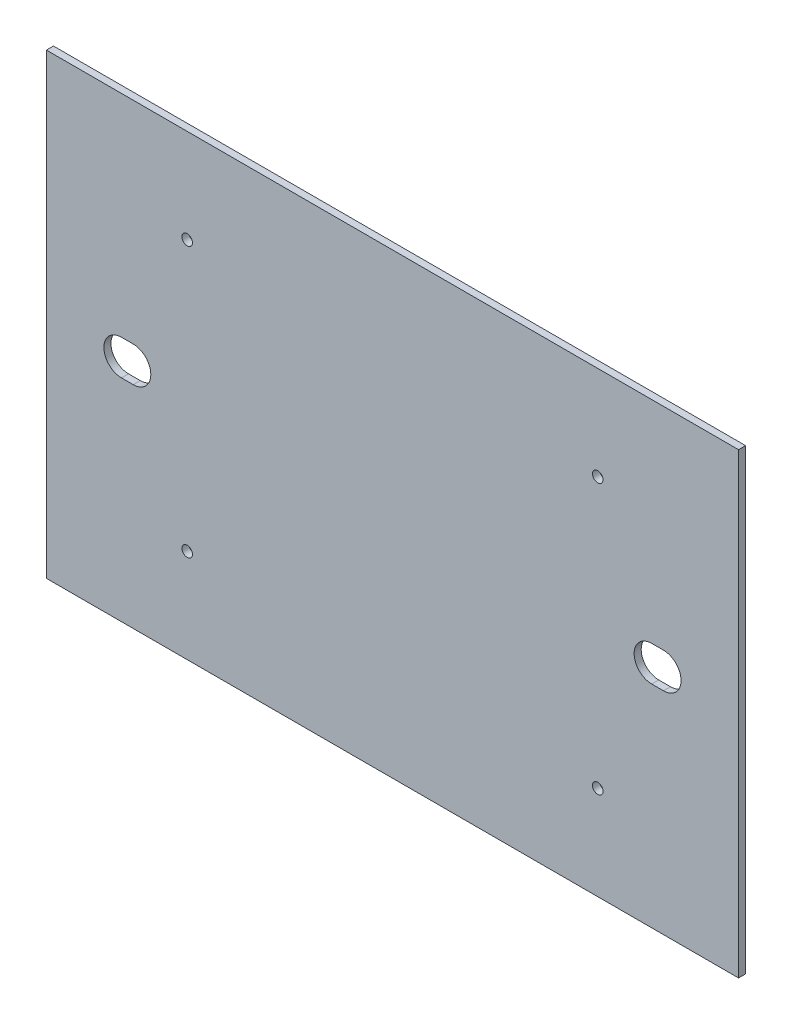
ISO-10303-21;
HEADER;
FILE_DESCRIPTION(('STEP AP214'),'2;1');
FILE_NAME('part.step','',(''),(''),'','','');
FILE_SCHEMA(('AUTOMOTIVE_DESIGN { 1 0 10303 214 1 1 1 1 }'));
ENDSEC;
DATA;
#1=APPLICATION_CONTEXT('core data for automotive mechanical design processes');
#2=APPLICATION_PROTOCOL_DEFINITION('international standard','automotive_design',2000,#1);
#3=PRODUCT_CONTEXT('',#1,'mechanical');
#4=PRODUCT('Part','Part','',(#3));
#5=PRODUCT_RELATED_PRODUCT_CATEGORY('part','',(#4));
#6=PRODUCT_DEFINITION_FORMATION('','',#4);
#7=PRODUCT_DEFINITION_CONTEXT('part definition',#1,'design');
#8=PRODUCT_DEFINITION('design','',#6,#7);
#9=PRODUCT_DEFINITION_SHAPE('','',#8);
#10=(LENGTH_UNIT() NAMED_UNIT(*) SI_UNIT(.MILLI.,.METRE.));
#11=(NAMED_UNIT(*) PLANE_ANGLE_UNIT() SI_UNIT($,.RADIAN.));
#12=(NAMED_UNIT(*) SI_UNIT($,.STERADIAN.) SOLID_ANGLE_UNIT());
#13=UNCERTAINTY_MEASURE_WITH_UNIT(LENGTH_MEASURE(1.E-05),#10,'distance_accuracy_value','');
#14=(GEOMETRIC_REPRESENTATION_CONTEXT(3) GLOBAL_UNCERTAINTY_ASSIGNED_CONTEXT((#13)) GLOBAL_UNIT_ASSIGNED_CONTEXT((#10,
#11,#12)) REPRESENTATION_CONTEXT('',''));
#15=CARTESIAN_POINT('',(0.,0.,0.));
#16=DIRECTION('',(0.,0.,1.));
#17=DIRECTION('',(1.,0.,0.));
#18=AXIS2_PLACEMENT_3D('',#15,#16,#17);
#19=CARTESIAN_POINT('',(0.,-195.,3.));
#20=DIRECTION('',(0.,0.,1.));
#21=DIRECTION('',(1.,0.,0.));
#22=AXIS2_PLACEMENT_3D('',#19,#20,#21);
#23=PLANE('',#22);
#24=DIRECTION('',(1.,0.,0.));
#25=VECTOR('',#24,1.);
#26=CARTESIAN_POINT('',(263.,-105.,3.));
#27=LINE('',#26,#25);
#28=CARTESIAN_POINT('',(258.,-105.,3.));
#29=VERTEX_POINT('',#28);
#30=CARTESIAN_POINT('',(263.,-105.,3.));
#31=VERTEX_POINT('',#30);
#32=EDGE_CURVE('E158',#29,#31,#27,.T.);
#33=ORIENTED_EDGE('',*,*,#32,.F.);
#34=CARTESIAN_POINT('',(258.,-97.5,3.));
#35=DIRECTION('',(0.,0.,1.));
#36=DIRECTION('',(-1.,0.,0.));
#37=AXIS2_PLACEMENT_3D('',#34,#35,#36);
#38=CIRCLE('',#37,7.50000000000001);
#39=CARTESIAN_POINT('',(258.,-90.,3.));
#40=VERTEX_POINT('',#39);
#41=EDGE_CURVE('E156',#40,#29,#38,.T.);
#42=ORIENTED_EDGE('',*,*,#41,.F.);
#43=DIRECTION('',(-1.,0.,0.));
#44=VECTOR('',#43,1.);
#45=CARTESIAN_POINT('',(263.,-90.,3.));
#46=LINE('',#45,#44);
#47=CARTESIAN_POINT('',(263.,-90.,3.));
#48=VERTEX_POINT('',#47);
#49=EDGE_CURVE('E164',#48,#40,#46,.T.);
#50=ORIENTED_EDGE('',*,*,#49,.F.);
#51=CARTESIAN_POINT('',(263.,-97.5,3.));
#52=DIRECTION('',(0.,0.,1.));
#53=DIRECTION('',(-1.,0.,0.));
#54=AXIS2_PLACEMENT_3D('',#51,#52,#53);
#55=CIRCLE('',#54,7.50000000000001);
#56=EDGE_CURVE('E161',#31,#48,#55,.T.);
#57=ORIENTED_EDGE('',*,*,#56,.F.);
#58=EDGE_LOOP('',(#33,#42,#50,#57));
#59=FACE_BOUND('',#58,.T.);
#60=CARTESIAN_POINT('',(235.,-155.,3.));
#61=DIRECTION('',(0.,0.,1.));
#62=DIRECTION('',(1.,0.,0.));
#63=AXIS2_PLACEMENT_3D('',#60,#61,#62);
#64=CIRCLE('',#63,2.25000000000001);
#65=CARTESIAN_POINT('',(237.25,-155.,3.));
#66=VERTEX_POINT('',#65);
#67=EDGE_CURVE('E193',#66,#66,#64,.T.);
#68=ORIENTED_EDGE('',*,*,#67,.F.);
#69=EDGE_LOOP('',(#68));
#70=FACE_BOUND('',#69,.T.);
#71=CARTESIAN_POINT('',(60.,-40.,3.));
#72=DIRECTION('',(0.,0.,1.));
#73=DIRECTION('',(1.,0.,0.));
#74=AXIS2_PLACEMENT_3D('',#71,#72,#73);
#75=CIRCLE('',#74,2.25);
#76=CARTESIAN_POINT('',(62.25,-40.,3.));
#77=VERTEX_POINT('',#76);
#78=EDGE_CURVE('E205',#77,#77,#75,.T.);
#79=ORIENTED_EDGE('',*,*,#78,.F.);
#80=EDGE_LOOP('',(#79));
#81=FACE_BOUND('',#80,.T.);
#82=DIRECTION('',(0.,-1.,0.));
#83=VECTOR('',#82,1.);
#84=CARTESIAN_POINT('',(0.,0.,3.));
#85=LINE('',#84,#83);
#86=CARTESIAN_POINT('',(0.,0.,3.));
#87=VERTEX_POINT('',#86);
#88=CARTESIAN_POINT('',(0.,-195.,3.));
#89=VERTEX_POINT('',#88);
#90=EDGE_CURVE('E211',#87,#89,#85,.T.);
#91=ORIENTED_EDGE('',*,*,#90,.T.);
#92=DIRECTION('',(1.,0.,0.));
#93=VECTOR('',#92,1.);
#94=CARTESIAN_POINT('',(0.,-195.,3.));
#95=LINE('',#94,#93);
#96=CARTESIAN_POINT('',(295.,-195.,3.));
#97=VERTEX_POINT('',#96);
#98=EDGE_CURVE('E214',#89,#97,#95,.T.);
#99=ORIENTED_EDGE('',*,*,#98,.T.);
#100=DIRECTION('',(0.,1.,0.));
#101=VECTOR('',#100,1.);
#102=CARTESIAN_POINT('',(295.,0.,3.));
#103=LINE('',#102,#101);
#104=CARTESIAN_POINT('',(295.,0.,3.));
#105=VERTEX_POINT('',#104);
#106=EDGE_CURVE('E217',#97,#105,#103,.T.);
#107=ORIENTED_EDGE('',*,*,#106,.T.);
#108=DIRECTION('',(-1.,0.,0.));
#109=VECTOR('',#108,1.);
#110=CARTESIAN_POINT('',(0.,0.,3.));
#111=LINE('',#110,#109);
#112=EDGE_CURVE('E219',#105,#87,#111,.T.);
#113=ORIENTED_EDGE('',*,*,#112,.T.);
#114=EDGE_LOOP('',(#91,#99,#107,#113));
#115=FACE_BOUND('',#114,.T.);
#116=CARTESIAN_POINT('',(235.,-40.,3.));
#117=DIRECTION('',(0.,0.,1.));
#118=DIRECTION('',(-1.,0.,0.));
#119=AXIS2_PLACEMENT_3D('',#116,#117,#118);
#120=CIRCLE('',#119,2.25000000000001);
#121=CARTESIAN_POINT('',(232.75,-40.,3.));
#122=VERTEX_POINT('',#121);
#123=EDGE_CURVE('E199',#122,#122,#120,.T.);
#124=ORIENTED_EDGE('',*,*,#123,.F.);
#125=EDGE_LOOP('',(#124));
#126=FACE_BOUND('',#125,.T.);
#127=CARTESIAN_POINT('',(60.,-155.,3.));
#128=DIRECTION('',(0.,0.,1.));
#129=DIRECTION('',(-1.,0.,0.));
#130=AXIS2_PLACEMENT_3D('',#127,#128,#129);
#131=CIRCLE('',#130,2.25);
#132=CARTESIAN_POINT('',(57.75,-155.,3.));
#133=VERTEX_POINT('',#132);
#134=EDGE_CURVE('E187',#133,#133,#131,.T.);
#135=ORIENTED_EDGE('',*,*,#134,.F.);
#136=EDGE_LOOP('',(#135));
#137=FACE_BOUND('',#136,.T.);
#138=DIRECTION('',(1.,0.,0.));
#139=VECTOR('',#138,1.);
#140=CARTESIAN_POINT('',(32.,-105.,3.));
#141=LINE('',#140,#139);
#142=CARTESIAN_POINT('',(32.,-105.,3.));
#143=VERTEX_POINT('',#142);
#144=CARTESIAN_POINT('',(37.,-105.,3.));
#145=VERTEX_POINT('',#144);
#146=EDGE_CURVE('E128',#143,#145,#141,.T.);
#147=ORIENTED_EDGE('',*,*,#146,.F.);
#148=CARTESIAN_POINT('',(32.,-97.5,3.));
#149=DIRECTION('',(0.,0.,1.));
#150=DIRECTION('',(1.,0.,0.));
#151=AXIS2_PLACEMENT_3D('',#148,#149,#150);
#152=CIRCLE('',#151,7.50000000000001);
#153=CARTESIAN_POINT('',(32.,-90.,3.));
#154=VERTEX_POINT('',#153);
#155=EDGE_CURVE('E120',#154,#143,#152,.T.);
#156=ORIENTED_EDGE('',*,*,#155,.F.);
#157=DIRECTION('',(-1.,0.,0.));
#158=VECTOR('',#157,1.);
#159=CARTESIAN_POINT('',(32.,-90.,3.));
#160=LINE('',#159,#158);
#161=CARTESIAN_POINT('',(37.,-90.,3.));
#162=VERTEX_POINT('',#161);
#163=EDGE_CURVE('E142',#162,#154,#160,.T.);
#164=ORIENTED_EDGE('',*,*,#163,.F.);
#165=CARTESIAN_POINT('',(37.,-97.5,3.));
#166=DIRECTION('',(0.,0.,1.));
#167=DIRECTION('',(1.,0.,0.));
#168=AXIS2_PLACEMENT_3D('',#165,#166,#167);
#169=CIRCLE('',#168,7.50000000000001);
#170=EDGE_CURVE('E140',#145,#162,#169,.T.);
#171=ORIENTED_EDGE('',*,*,#170,.F.);
#172=EDGE_LOOP('',(#147,#156,#164,#171));
#173=FACE_BOUND('',#172,.T.);
#174=ADVANCED_FACE('F31',(#59,#70,#81,#115,#126,#137,#173),#23,.T.);
#175=CARTESIAN_POINT('',(0.,-195.,0.));
#176=DIRECTION('',(0.,0.,1.));
#177=DIRECTION('',(1.,0.,0.));
#178=AXIS2_PLACEMENT_3D('',#175,#176,#177);
#179=PLANE('',#178);
#180=CARTESIAN_POINT('',(258.,-97.5,0.));
#181=DIRECTION('',(0.,0.,1.));
#182=DIRECTION('',(-1.,0.,0.));
#183=AXIS2_PLACEMENT_3D('',#180,#181,#182);
#184=CIRCLE('',#183,7.50000000000001);
#185=CARTESIAN_POINT('',(258.,-90.,0.));
#186=VERTEX_POINT('',#185);
#187=CARTESIAN_POINT('',(258.,-105.,0.));
#188=VERTEX_POINT('',#187);
#189=EDGE_CURVE('E136',#186,#188,#184,.T.);
#190=ORIENTED_EDGE('',*,*,#189,.T.);
#191=DIRECTION('',(1.,0.,0.));
#192=VECTOR('',#191,1.);
#193=CARTESIAN_POINT('',(263.,-105.,0.));
#194=LINE('',#193,#192);
#195=CARTESIAN_POINT('',(263.,-105.,0.));
#196=VERTEX_POINT('',#195);
#197=EDGE_CURVE('E169',#188,#196,#194,.T.);
#198=ORIENTED_EDGE('',*,*,#197,.T.);
#199=CARTESIAN_POINT('',(263.,-97.5,0.));
#200=DIRECTION('',(0.,0.,1.));
#201=DIRECTION('',(-1.,0.,0.));
#202=AXIS2_PLACEMENT_3D('',#199,#200,#201);
#203=CIRCLE('',#202,7.50000000000001);
#204=CARTESIAN_POINT('',(263.,-90.,0.));
#205=VERTEX_POINT('',#204);
#206=EDGE_CURVE('E172',#196,#205,#203,.T.);
#207=ORIENTED_EDGE('',*,*,#206,.T.);
#208=DIRECTION('',(-1.,0.,0.));
#209=VECTOR('',#208,1.);
#210=CARTESIAN_POINT('',(263.,-90.,0.));
#211=LINE('',#210,#209);
#212=EDGE_CURVE('E159',#205,#186,#211,.T.);
#213=ORIENTED_EDGE('',*,*,#212,.T.);
#214=EDGE_LOOP('',(#190,#198,#207,#213));
#215=FACE_BOUND('',#214,.T.);
#216=CARTESIAN_POINT('',(235.,-155.,0.));
#217=DIRECTION('',(0.,0.,1.));
#218=DIRECTION('',(1.,0.,0.));
#219=AXIS2_PLACEMENT_3D('',#216,#217,#218);
#220=CIRCLE('',#219,2.25000000000001);
#221=CARTESIAN_POINT('',(237.25,-155.,0.));
#222=VERTEX_POINT('',#221);
#223=EDGE_CURVE('E190',#222,#222,#220,.T.);
#224=ORIENTED_EDGE('',*,*,#223,.T.);
#225=EDGE_LOOP('',(#224));
#226=FACE_BOUND('',#225,.T.);
#227=CARTESIAN_POINT('',(60.,-40.,0.));
#228=DIRECTION('',(0.,0.,1.));
#229=DIRECTION('',(1.,0.,0.));
#230=AXIS2_PLACEMENT_3D('',#227,#228,#229);
#231=CIRCLE('',#230,2.25);
#232=CARTESIAN_POINT('',(62.25,-40.,0.));
#233=VERTEX_POINT('',#232);
#234=EDGE_CURVE('E202',#233,#233,#231,.T.);
#235=ORIENTED_EDGE('',*,*,#234,.T.);
#236=EDGE_LOOP('',(#235));
#237=FACE_BOUND('',#236,.T.);
#238=DIRECTION('',(0.,-1.,0.));
#239=VECTOR('',#238,1.);
#240=CARTESIAN_POINT('',(0.,0.,0.));
#241=LINE('',#240,#239);
#242=CARTESIAN_POINT('',(0.,0.,0.));
#243=VERTEX_POINT('',#242);
#244=CARTESIAN_POINT('',(0.,-195.,0.));
#245=VERTEX_POINT('',#244);
#246=EDGE_CURVE('E208',#243,#245,#241,.T.);
#247=ORIENTED_EDGE('',*,*,#246,.F.);
#248=DIRECTION('',(-1.,0.,0.));
#249=VECTOR('',#248,1.);
#250=CARTESIAN_POINT('',(0.,0.,0.));
#251=LINE('',#250,#249);
#252=CARTESIAN_POINT('',(295.,0.,0.));
#253=VERTEX_POINT('',#252);
#254=EDGE_CURVE('E215',#253,#243,#251,.T.);
#255=ORIENTED_EDGE('',*,*,#254,.F.);
#256=DIRECTION('',(0.,1.,0.));
#257=VECTOR('',#256,1.);
#258=CARTESIAN_POINT('',(295.,0.,0.));
#259=LINE('',#258,#257);
#260=CARTESIAN_POINT('',(295.,-195.,0.));
#261=VERTEX_POINT('',#260);
#262=EDGE_CURVE('E226',#261,#253,#259,.T.);
#263=ORIENTED_EDGE('',*,*,#262,.F.);
#264=DIRECTION('',(1.,0.,0.));
#265=VECTOR('',#264,1.);
#266=CARTESIAN_POINT('',(0.,-195.,0.));
#267=LINE('',#266,#265);
#268=EDGE_CURVE('E224',#245,#261,#267,.T.);
#269=ORIENTED_EDGE('',*,*,#268,.F.);
#270=EDGE_LOOP('',(#247,#255,#263,#269));
#271=FACE_BOUND('',#270,.T.);
#272=CARTESIAN_POINT('',(235.,-40.,0.));
#273=DIRECTION('',(0.,0.,1.));
#274=DIRECTION('',(-1.,0.,0.));
#275=AXIS2_PLACEMENT_3D('',#272,#273,#274);
#276=CIRCLE('',#275,2.25000000000001);
#277=CARTESIAN_POINT('',(232.75,-40.,0.));
#278=VERTEX_POINT('',#277);
#279=EDGE_CURVE('E196',#278,#278,#276,.T.);
#280=ORIENTED_EDGE('',*,*,#279,.T.);
#281=EDGE_LOOP('',(#280));
#282=FACE_BOUND('',#281,.T.);
#283=CARTESIAN_POINT('',(60.,-155.,0.));
#284=DIRECTION('',(0.,0.,1.));
#285=DIRECTION('',(-1.,0.,0.));
#286=AXIS2_PLACEMENT_3D('',#283,#284,#285);
#287=CIRCLE('',#286,2.25);
#288=CARTESIAN_POINT('',(57.75,-155.,0.));
#289=VERTEX_POINT('',#288);
#290=EDGE_CURVE('E186',#289,#289,#287,.T.);
#291=ORIENTED_EDGE('',*,*,#290,.T.);
#292=EDGE_LOOP('',(#291));
#293=FACE_BOUND('',#292,.T.);
#294=CARTESIAN_POINT('',(32.,-97.5,0.));
#295=DIRECTION('',(0.,0.,1.));
#296=DIRECTION('',(1.,0.,0.));
#297=AXIS2_PLACEMENT_3D('',#294,#295,#296);
#298=CIRCLE('',#297,7.50000000000001);
#299=CARTESIAN_POINT('',(32.,-90.,0.));
#300=VERTEX_POINT('',#299);
#301=CARTESIAN_POINT('',(32.,-105.,0.));
#302=VERTEX_POINT('',#301);
#303=EDGE_CURVE('E54',#300,#302,#298,.T.);
#304=ORIENTED_EDGE('',*,*,#303,.T.);
#305=DIRECTION('',(1.,0.,0.));
#306=VECTOR('',#305,1.);
#307=CARTESIAN_POINT('',(32.,-105.,0.));
#308=LINE('',#307,#306);
#309=CARTESIAN_POINT('',(37.,-105.,0.));
#310=VERTEX_POINT('',#309);
#311=EDGE_CURVE('E135',#302,#310,#308,.T.);
#312=ORIENTED_EDGE('',*,*,#311,.T.);
#313=CARTESIAN_POINT('',(37.,-97.5,0.));
#314=DIRECTION('',(0.,0.,1.));
#315=DIRECTION('',(1.,0.,0.));
#316=AXIS2_PLACEMENT_3D('',#313,#314,#315);
#317=CIRCLE('',#316,7.50000000000001);
#318=CARTESIAN_POINT('',(37.,-90.,0.));
#319=VERTEX_POINT('',#318);
#320=EDGE_CURVE('E148',#310,#319,#317,.T.);
#321=ORIENTED_EDGE('',*,*,#320,.T.);
#322=DIRECTION('',(-1.,0.,0.));
#323=VECTOR('',#322,1.);
#324=CARTESIAN_POINT('',(32.,-90.,0.));
#325=LINE('',#324,#323);
#326=EDGE_CURVE('E129',#319,#300,#325,.T.);
#327=ORIENTED_EDGE('',*,*,#326,.T.);
#328=EDGE_LOOP('',(#304,#312,#321,#327));
#329=FACE_BOUND('',#328,.T.);
#330=ADVANCED_FACE('F244',(#215,#226,#237,#271,#282,#293,#329),#179,.F.);
#331=CARTESIAN_POINT('',(0.,0.,3.));
#332=DIRECTION('',(1.,0.,0.));
#333=DIRECTION('',(0.,1.,0.));
#334=AXIS2_PLACEMENT_3D('',#331,#332,#333);
#335=PLANE('',#334);
#336=ORIENTED_EDGE('',*,*,#246,.T.);
#337=DIRECTION('',(0.,0.,-1.));
#338=VECTOR('',#337,1.);
#339=CARTESIAN_POINT('',(0.,-195.,3.));
#340=LINE('',#339,#338);
#341=EDGE_CURVE('E11',#89,#245,#340,.T.);
#342=ORIENTED_EDGE('',*,*,#341,.F.);
#343=ORIENTED_EDGE('',*,*,#90,.F.);
#344=DIRECTION('',(0.,0.,-1.));
#345=VECTOR('',#344,1.);
#346=CARTESIAN_POINT('',(0.,0.,3.));
#347=LINE('',#346,#345);
#348=EDGE_CURVE('E221',#87,#243,#347,.T.);
#349=ORIENTED_EDGE('',*,*,#348,.T.);
#350=EDGE_LOOP('',(#336,#342,#343,#349));
#351=FACE_BOUND('',#350,.T.);
#352=ADVANCED_FACE('F33',(#351),#335,.F.);
#353=CARTESIAN_POINT('',(0.,-195.,3.));
#354=DIRECTION('',(0.,1.,0.));
#355=DIRECTION('',(0.,0.,1.));
#356=AXIS2_PLACEMENT_3D('',#353,#354,#355);
#357=PLANE('',#356);
#358=ORIENTED_EDGE('',*,*,#268,.T.);
#359=DIRECTION('',(0.,0.,-1.));
#360=VECTOR('',#359,1.);
#361=CARTESIAN_POINT('',(295.,-195.,3.));
#362=LINE('',#361,#360);
#363=EDGE_CURVE('E39',#97,#261,#362,.T.);
#364=ORIENTED_EDGE('',*,*,#363,.F.);
#365=ORIENTED_EDGE('',*,*,#98,.F.);
#366=ORIENTED_EDGE('',*,*,#341,.T.);
#367=EDGE_LOOP('',(#358,#364,#365,#366));
#368=FACE_BOUND('',#367,.T.);
#369=ADVANCED_FACE('F255',(#368),#357,.F.);
#370=CARTESIAN_POINT('',(295.,0.,3.));
#371=DIRECTION('',(-1.,0.,0.));
#372=DIRECTION('',(0.,0.,1.));
#373=AXIS2_PLACEMENT_3D('',#370,#371,#372);
#374=PLANE('',#373);
#375=ORIENTED_EDGE('',*,*,#262,.T.);
#376=DIRECTION('',(0.,0.,-1.));
#377=VECTOR('',#376,1.);
#378=CARTESIAN_POINT('',(295.,0.,3.));
#379=LINE('',#378,#377);
#380=EDGE_CURVE('E231',#105,#253,#379,.T.);
#381=ORIENTED_EDGE('',*,*,#380,.F.);
#382=ORIENTED_EDGE('',*,*,#106,.F.);
#383=ORIENTED_EDGE('',*,*,#363,.T.);
#384=EDGE_LOOP('',(#375,#381,#382,#383));
#385=FACE_BOUND('',#384,.T.);
#386=ADVANCED_FACE('F238',(#385),#374,.F.);
#387=CARTESIAN_POINT('',(0.,0.,3.));
#388=DIRECTION('',(0.,-1.,0.));
#389=DIRECTION('',(0.,0.,-1.));
#390=AXIS2_PLACEMENT_3D('',#387,#388,#389);
#391=PLANE('',#390);
#392=ORIENTED_EDGE('',*,*,#254,.T.);
#393=ORIENTED_EDGE('',*,*,#348,.F.);
#394=ORIENTED_EDGE('',*,*,#112,.F.);
#395=ORIENTED_EDGE('',*,*,#380,.T.);
#396=EDGE_LOOP('',(#392,#393,#394,#395));
#397=FACE_BOUND('',#396,.T.);
#398=ADVANCED_FACE('F248',(#397),#391,.F.);
#399=CARTESIAN_POINT('',(60.,-40.,3.));
#400=DIRECTION('',(0.,0.,-1.));
#401=DIRECTION('',(-1.,0.,0.));
#402=AXIS2_PLACEMENT_3D('',#399,#400,#401);
#403=CYLINDRICAL_SURFACE('',#402,2.25);
#404=ORIENTED_EDGE('',*,*,#78,.T.);
#405=EDGE_LOOP('',(#404));
#406=FACE_BOUND('',#405,.T.);
#407=ORIENTED_EDGE('',*,*,#234,.F.);
#408=EDGE_LOOP('',(#407));
#409=FACE_BOUND('',#408,.T.);
#410=ADVANCED_FACE('F273',(#406,#409),#403,.F.);
#411=CARTESIAN_POINT('',(235.,-40.,3.));
#412=DIRECTION('',(0.,0.,-1.));
#413=DIRECTION('',(-1.,0.,0.));
#414=AXIS2_PLACEMENT_3D('',#411,#412,#413);
#415=CYLINDRICAL_SURFACE('',#414,2.25000000000001);
#416=ORIENTED_EDGE('',*,*,#123,.T.);
#417=EDGE_LOOP('',(#416));
#418=FACE_BOUND('',#417,.T.);
#419=ORIENTED_EDGE('',*,*,#279,.F.);
#420=EDGE_LOOP('',(#419));
#421=FACE_BOUND('',#420,.T.);
#422=ADVANCED_FACE('F280',(#418,#421),#415,.F.);
#423=CARTESIAN_POINT('',(235.,-155.,3.));
#424=DIRECTION('',(0.,0.,-1.));
#425=DIRECTION('',(-1.,0.,0.));
#426=AXIS2_PLACEMENT_3D('',#423,#424,#425);
#427=CYLINDRICAL_SURFACE('',#426,2.25000000000001);
#428=ORIENTED_EDGE('',*,*,#67,.T.);
#429=EDGE_LOOP('',(#428));
#430=FACE_BOUND('',#429,.T.);
#431=ORIENTED_EDGE('',*,*,#223,.F.);
#432=EDGE_LOOP('',(#431));
#433=FACE_BOUND('',#432,.T.);
#434=ADVANCED_FACE('F285',(#430,#433),#427,.F.);
#435=CARTESIAN_POINT('',(60.,-155.,3.));
#436=DIRECTION('',(0.,0.,-1.));
#437=DIRECTION('',(-1.,0.,0.));
#438=AXIS2_PLACEMENT_3D('',#435,#436,#437);
#439=CYLINDRICAL_SURFACE('',#438,2.25);
#440=ORIENTED_EDGE('',*,*,#134,.T.);
#441=EDGE_LOOP('',(#440));
#442=FACE_BOUND('',#441,.T.);
#443=ORIENTED_EDGE('',*,*,#290,.F.);
#444=EDGE_LOOP('',(#443));
#445=FACE_BOUND('',#444,.T.);
#446=ADVANCED_FACE('F295',(#442,#445),#439,.F.);
#447=CARTESIAN_POINT('',(258.,-97.5,3.));
#448=DIRECTION('',(0.,0.,-1.));
#449=DIRECTION('',(-1.,0.,0.));
#450=AXIS2_PLACEMENT_3D('',#447,#448,#449);
#451=CYLINDRICAL_SURFACE('',#450,7.50000000000001);
#452=ORIENTED_EDGE('',*,*,#189,.F.);
#453=DIRECTION('',(0.,0.,-1.));
#454=VECTOR('',#453,1.);
#455=CARTESIAN_POINT('',(258.,-90.,3.));
#456=LINE('',#455,#454);
#457=EDGE_CURVE('E166',#40,#186,#456,.T.);
#458=ORIENTED_EDGE('',*,*,#457,.F.);
#459=ORIENTED_EDGE('',*,*,#41,.T.);
#460=DIRECTION('',(0.,0.,-1.));
#461=VECTOR('',#460,1.);
#462=CARTESIAN_POINT('',(258.,-105.,3.));
#463=LINE('',#462,#461);
#464=EDGE_CURVE('E183',#29,#188,#463,.T.);
#465=ORIENTED_EDGE('',*,*,#464,.T.);
#466=EDGE_LOOP('',(#452,#458,#459,#465));
#467=FACE_BOUND('',#466,.T.);
#468=ADVANCED_FACE('F302',(#467),#451,.F.);
#469=CARTESIAN_POINT('',(263.,-105.,3.));
#470=DIRECTION('',(0.,1.,0.));
#471=DIRECTION('',(0.,0.,1.));
#472=AXIS2_PLACEMENT_3D('',#469,#470,#471);
#473=PLANE('',#472);
#474=ORIENTED_EDGE('',*,*,#197,.F.);
#475=ORIENTED_EDGE('',*,*,#464,.F.);
#476=ORIENTED_EDGE('',*,*,#32,.T.);
#477=DIRECTION('',(0.,0.,-1.));
#478=VECTOR('',#477,1.);
#479=CARTESIAN_POINT('',(263.,-105.,3.));
#480=LINE('',#479,#478);
#481=EDGE_CURVE('E181',#31,#196,#480,.T.);
#482=ORIENTED_EDGE('',*,*,#481,.T.);
#483=EDGE_LOOP('',(#474,#475,#476,#482));
#484=FACE_BOUND('',#483,.T.);
#485=ADVANCED_FACE('F306',(#484),#473,.T.);
#486=CARTESIAN_POINT('',(263.,-97.5,3.));
#487=DIRECTION('',(0.,0.,-1.));
#488=DIRECTION('',(-1.,0.,0.));
#489=AXIS2_PLACEMENT_3D('',#486,#487,#488);
#490=CYLINDRICAL_SURFACE('',#489,7.50000000000001);
#491=ORIENTED_EDGE('',*,*,#206,.F.);
#492=ORIENTED_EDGE('',*,*,#481,.F.);
#493=ORIENTED_EDGE('',*,*,#56,.T.);
#494=DIRECTION('',(0.,0.,-1.));
#495=VECTOR('',#494,1.);
#496=CARTESIAN_POINT('',(263.,-90.,3.));
#497=LINE('',#496,#495);
#498=EDGE_CURVE('E179',#48,#205,#497,.T.);
#499=ORIENTED_EDGE('',*,*,#498,.T.);
#500=EDGE_LOOP('',(#491,#492,#493,#499));
#501=FACE_BOUND('',#500,.T.);
#502=ADVANCED_FACE('F310',(#501),#490,.F.);
#503=CARTESIAN_POINT('',(263.,-90.,3.));
#504=DIRECTION('',(0.,-1.,0.));
#505=DIRECTION('',(0.,0.,-1.));
#506=AXIS2_PLACEMENT_3D('',#503,#504,#505);
#507=PLANE('',#506);
#508=ORIENTED_EDGE('',*,*,#212,.F.);
#509=ORIENTED_EDGE('',*,*,#498,.F.);
#510=ORIENTED_EDGE('',*,*,#49,.T.);
#511=ORIENTED_EDGE('',*,*,#457,.T.);
#512=EDGE_LOOP('',(#508,#509,#510,#511));
#513=FACE_BOUND('',#512,.T.);
#514=ADVANCED_FACE('F314',(#513),#507,.T.);
#515=CARTESIAN_POINT('',(32.,-97.5,3.));
#516=DIRECTION('',(0.,0.,-1.));
#517=DIRECTION('',(-1.,0.,0.));
#518=AXIS2_PLACEMENT_3D('',#515,#516,#517);
#519=CYLINDRICAL_SURFACE('',#518,7.50000000000001);
#520=ORIENTED_EDGE('',*,*,#303,.F.);
#521=DIRECTION('',(0.,0.,-1.));
#522=VECTOR('',#521,1.);
#523=CARTESIAN_POINT('',(32.,-90.,3.));
#524=LINE('',#523,#522);
#525=EDGE_CURVE('E124',#154,#300,#524,.T.);
#526=ORIENTED_EDGE('',*,*,#525,.F.);
#527=ORIENTED_EDGE('',*,*,#155,.T.);
#528=DIRECTION('',(0.,0.,-1.));
#529=VECTOR('',#528,1.);
#530=CARTESIAN_POINT('',(32.,-105.,3.));
#531=LINE('',#530,#529);
#532=EDGE_CURVE('E123',#143,#302,#531,.T.);
#533=ORIENTED_EDGE('',*,*,#532,.T.);
#534=EDGE_LOOP('',(#520,#526,#527,#533));
#535=FACE_BOUND('',#534,.T.);
#536=ADVANCED_FACE('F122',(#535),#519,.F.);
#537=CARTESIAN_POINT('',(32.,-105.,3.));
#538=DIRECTION('',(0.,1.,0.));
#539=DIRECTION('',(0.,0.,1.));
#540=AXIS2_PLACEMENT_3D('',#537,#538,#539);
#541=PLANE('',#540);
#542=ORIENTED_EDGE('',*,*,#311,.F.);
#543=ORIENTED_EDGE('',*,*,#532,.F.);
#544=ORIENTED_EDGE('',*,*,#146,.T.);
#545=DIRECTION('',(0.,0.,-1.));
#546=VECTOR('',#545,1.);
#547=CARTESIAN_POINT('',(37.,-105.,3.));
#548=LINE('',#547,#546);
#549=EDGE_CURVE('E137',#145,#310,#548,.T.);
#550=ORIENTED_EDGE('',*,*,#549,.T.);
#551=EDGE_LOOP('',(#542,#543,#544,#550));
#552=FACE_BOUND('',#551,.T.);
#553=ADVANCED_FACE('F132',(#552),#541,.T.);
#554=CARTESIAN_POINT('',(37.,-97.5,3.));
#555=DIRECTION('',(0.,0.,-1.));
#556=DIRECTION('',(-1.,0.,0.));
#557=AXIS2_PLACEMENT_3D('',#554,#555,#556);
#558=CYLINDRICAL_SURFACE('',#557,7.50000000000001);
#559=ORIENTED_EDGE('',*,*,#320,.F.);
#560=ORIENTED_EDGE('',*,*,#549,.F.);
#561=ORIENTED_EDGE('',*,*,#170,.T.);
#562=DIRECTION('',(0.,0.,-1.));
#563=VECTOR('',#562,1.);
#564=CARTESIAN_POINT('',(37.,-90.,3.));
#565=LINE('',#564,#563);
#566=EDGE_CURVE('E46',#162,#319,#565,.T.);
#567=ORIENTED_EDGE('',*,*,#566,.T.);
#568=EDGE_LOOP('',(#559,#560,#561,#567));
#569=FACE_BOUND('',#568,.T.);
#570=ADVANCED_FACE('F323',(#569),#558,.F.);
#571=CARTESIAN_POINT('',(32.,-90.,3.));
#572=DIRECTION('',(0.,-1.,0.));
#573=DIRECTION('',(0.,0.,-1.));
#574=AXIS2_PLACEMENT_3D('',#571,#572,#573);
#575=PLANE('',#574);
#576=ORIENTED_EDGE('',*,*,#326,.F.);
#577=ORIENTED_EDGE('',*,*,#566,.F.);
#578=ORIENTED_EDGE('',*,*,#163,.T.);
#579=ORIENTED_EDGE('',*,*,#525,.T.);
#580=EDGE_LOOP('',(#576,#577,#578,#579));
#581=FACE_BOUND('',#580,.T.);
#582=ADVANCED_FACE('F326',(#581),#575,.T.);
#583=CLOSED_SHELL('',(#174,#330,#352,#369,#386,#398,#410,#422,#434,#446,#468,#485,#502,#514,
#536,#553,#570,#582));
#584=MANIFOLD_SOLID_BREP('B2',#583);
#585=ADVANCED_BREP_SHAPE_REPRESENTATION('',(#18,#584),#14);
#586=SHAPE_DEFINITION_REPRESENTATION(#9,#585);
ENDSEC;
END-ISO-10303-21;
